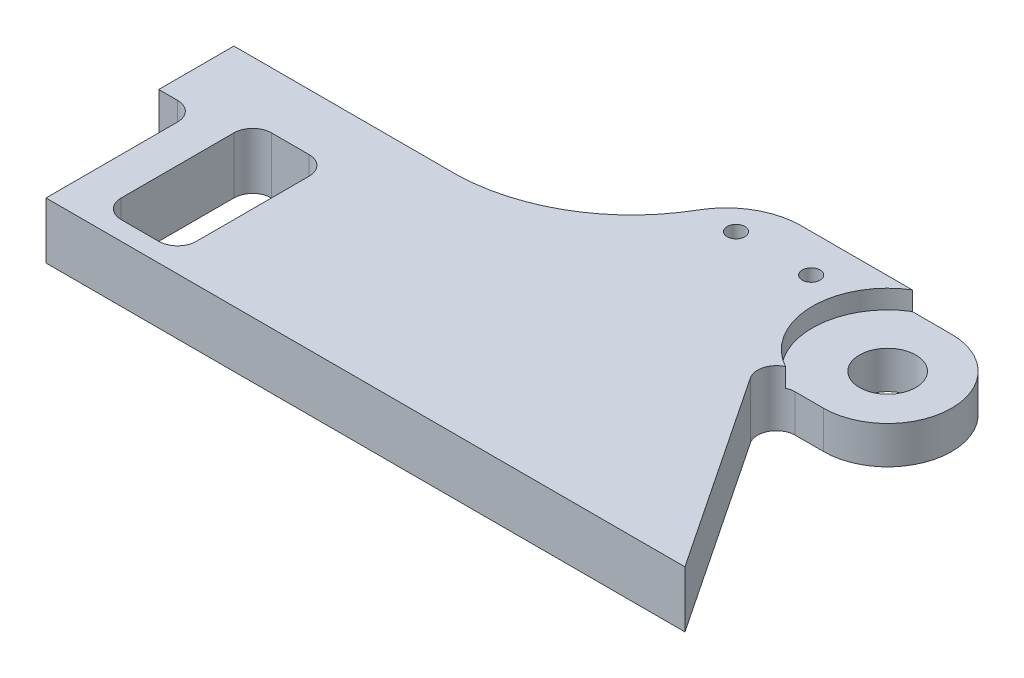
ISO-10303-21;
HEADER;
FILE_DESCRIPTION(('STEP AP214'),'2;1');
FILE_NAME('part.step','',(''),(''),'','','');
FILE_SCHEMA(('AUTOMOTIVE_DESIGN { 1 0 10303 214 1 1 1 1 }'));
ENDSEC;
DATA;
#1=APPLICATION_CONTEXT('core data for automotive mechanical design processes');
#2=APPLICATION_PROTOCOL_DEFINITION('international standard','automotive_design',2000,#1);
#3=PRODUCT_CONTEXT('',#1,'mechanical');
#4=PRODUCT('Part','Part','',(#3));
#5=PRODUCT_RELATED_PRODUCT_CATEGORY('part','',(#4));
#6=PRODUCT_DEFINITION_FORMATION('','',#4);
#7=PRODUCT_DEFINITION_CONTEXT('part definition',#1,'design');
#8=PRODUCT_DEFINITION('design','',#6,#7);
#9=PRODUCT_DEFINITION_SHAPE('','',#8);
#10=(LENGTH_UNIT() NAMED_UNIT(*) SI_UNIT(.MILLI.,.METRE.));
#11=(NAMED_UNIT(*) PLANE_ANGLE_UNIT() SI_UNIT($,.RADIAN.));
#12=(NAMED_UNIT(*) SI_UNIT($,.STERADIAN.) SOLID_ANGLE_UNIT());
#13=UNCERTAINTY_MEASURE_WITH_UNIT(LENGTH_MEASURE(1.E-05),#10,'distance_accuracy_value','');
#14=(GEOMETRIC_REPRESENTATION_CONTEXT(3) GLOBAL_UNCERTAINTY_ASSIGNED_CONTEXT((#13)) GLOBAL_UNIT_ASSIGNED_CONTEXT((#10,
#11,#12)) REPRESENTATION_CONTEXT('',''));
#15=CARTESIAN_POINT('',(0.,0.,0.));
#16=DIRECTION('',(0.,0.,1.));
#17=DIRECTION('',(1.,0.,0.));
#18=AXIS2_PLACEMENT_3D('',#15,#16,#17);
#19=CARTESIAN_POINT('',(99.6289220182295,9.525,0.));
#20=DIRECTION('',(0.,0.,-1.));
#21=DIRECTION('',(-1.,0.,0.));
#22=AXIS2_PLACEMENT_3D('',#19,#20,#21);
#23=PLANE('',#22);
#24=DIRECTION('',(1.,0.,0.));
#25=VECTOR('',#24,1.);
#26=CARTESIAN_POINT('',(99.6289220182295,6.35,0.));
#27=LINE('',#26,#25);
#28=CARTESIAN_POINT('',(94.8325417665327,6.35,0.));
#29=VERTEX_POINT('',#28);
#30=CARTESIAN_POINT('',(99.6289220182295,6.35,0.));
#31=VERTEX_POINT('',#30);
#32=EDGE_CURVE('E432',#29,#31,#27,.T.);
#33=ORIENTED_EDGE('',*,*,#32,.F.);
#34=DIRECTION('',(0.,-1.,0.));
#35=VECTOR('',#34,1.);
#36=CARTESIAN_POINT('',(94.8325417665327,0.,0.));
#37=LINE('',#36,#35);
#38=CARTESIAN_POINT('',(94.8325417665327,0.,0.));
#39=VERTEX_POINT('',#38);
#40=EDGE_CURVE('E314',#29,#39,#37,.T.);
#41=ORIENTED_EDGE('',*,*,#40,.T.);
#42=DIRECTION('',(1.,0.,0.));
#43=VECTOR('',#42,1.);
#44=CARTESIAN_POINT('',(99.6289220182295,0.,0.));
#45=LINE('',#44,#43);
#46=CARTESIAN_POINT('',(99.6289220182295,0.,0.));
#47=VERTEX_POINT('',#46);
#48=EDGE_CURVE('E262',#39,#47,#45,.T.);
#49=ORIENTED_EDGE('',*,*,#48,.T.);
#50=DIRECTION('',(0.,-1.,0.));
#51=VECTOR('',#50,1.);
#52=CARTESIAN_POINT('',(99.6289220182295,9.525,0.));
#53=LINE('',#52,#51);
#54=EDGE_CURVE('E299',#31,#47,#53,.T.);
#55=ORIENTED_EDGE('',*,*,#54,.F.);
#56=EDGE_LOOP('',(#33,#41,#49,#55));
#57=FACE_BOUND('',#56,.T.);
#58=ADVANCED_FACE('F39',(#57),#23,.F.);
#59=CARTESIAN_POINT('',(99.6289220182295,9.525,-10.8159932240115));
#60=DIRECTION('',(0.,-1.,0.));
#61=DIRECTION('',(0.,0.,-1.));
#62=AXIS2_PLACEMENT_3D('',#59,#60,#61);
#63=CYLINDRICAL_SURFACE('',#62,10.8159932240115);
#64=CARTESIAN_POINT('',(99.6289220182295,6.35,-10.8159932240115));
#65=DIRECTION('',(0.,1.,0.));
#66=DIRECTION('',(0.,0.,1.));
#67=AXIS2_PLACEMENT_3D('',#64,#65,#66);
#68=CIRCLE('',#67,10.8159932240115);
#69=CARTESIAN_POINT('',(99.6289220182295,6.35,-21.6319864480231));
#70=VERTEX_POINT('',#69);
#71=EDGE_CURVE('E436',#31,#70,#68,.T.);
#72=ORIENTED_EDGE('',*,*,#71,.F.);
#73=ORIENTED_EDGE('',*,*,#54,.T.);
#74=CARTESIAN_POINT('',(99.6289220182295,0.,-10.8159932240115));
#75=DIRECTION('',(0.,1.,0.));
#76=DIRECTION('',(0.,0.,-1.));
#77=AXIS2_PLACEMENT_3D('',#74,#75,#76);
#78=CIRCLE('',#77,10.8159932240115);
#79=CARTESIAN_POINT('',(99.6289220182295,0.,-21.6319864480231));
#80=VERTEX_POINT('',#79);
#81=EDGE_CURVE('E266',#47,#80,#78,.T.);
#82=ORIENTED_EDGE('',*,*,#81,.T.);
#83=DIRECTION('',(0.,-1.,0.));
#84=VECTOR('',#83,1.);
#85=CARTESIAN_POINT('',(99.6289220182295,9.525,-21.6319864480231));
#86=LINE('',#85,#84);
#87=EDGE_CURVE('E296',#70,#80,#86,.T.);
#88=ORIENTED_EDGE('',*,*,#87,.F.);
#89=EDGE_LOOP('',(#72,#73,#82,#88));
#90=FACE_BOUND('',#89,.T.);
#91=ADVANCED_FACE('F499',(#90),#63,.T.);
#92=CARTESIAN_POINT('',(99.6289220182295,9.525,-10.8159932240115));
#93=DIRECTION('',(0.,-1.,0.));
#94=DIRECTION('',(0.,0.,-1.));
#95=AXIS2_PLACEMENT_3D('',#92,#93,#94);
#96=CYLINDRICAL_SURFACE('',#95,4.76250000000001);
#97=CARTESIAN_POINT('',(99.6289220182295,0.,-10.8159932240115));
#98=DIRECTION('',(0.,1.,0.));
#99=DIRECTION('',(0.,0.,1.));
#100=AXIS2_PLACEMENT_3D('',#97,#98,#99);
#101=CIRCLE('',#100,4.76250000000001);
#102=CARTESIAN_POINT('',(99.6289220182295,0.,-6.05349322401153));
#103=VERTEX_POINT('',#102);
#104=EDGE_CURVE('E248',#103,#103,#101,.T.);
#105=ORIENTED_EDGE('',*,*,#104,.F.);
#106=EDGE_LOOP('',(#105));
#107=FACE_BOUND('',#106,.T.);
#108=CARTESIAN_POINT('',(99.6289220182295,6.35,-10.8159932240115));
#109=DIRECTION('',(0.,1.,0.));
#110=DIRECTION('',(0.,0.,1.));
#111=AXIS2_PLACEMENT_3D('',#108,#109,#110);
#112=CIRCLE('',#111,4.76250000000001);
#113=CARTESIAN_POINT('',(99.6289220182295,6.35,-6.05349322401153));
#114=VERTEX_POINT('',#113);
#115=EDGE_CURVE('E207',#114,#114,#112,.T.);
#116=ORIENTED_EDGE('',*,*,#115,.T.);
#117=EDGE_LOOP('',(#116));
#118=FACE_BOUND('',#117,.T.);
#119=ADVANCED_FACE('F547',(#107,#118),#96,.F.);
#120=CARTESIAN_POINT('',(36.7936206027921,9.525,-30.4519912792341));
#121=DIRECTION('',(0.,-1.,0.));
#122=DIRECTION('',(0.,0.,-1.));
#123=AXIS2_PLACEMENT_3D('',#120,#121,#122);
#124=PLANE('',#123);
#125=DIRECTION('',(0.,0.,1.));
#126=VECTOR('',#125,1.);
#127=CARTESIAN_POINT('',(12.7,9.525,9.52500000000002));
#128=LINE('',#127,#126);
#129=CARTESIAN_POINT('',(12.7,9.525,12.7));
#130=VERTEX_POINT('',#129);
#131=CARTESIAN_POINT('',(12.7,9.525,31.75));
#132=VERTEX_POINT('',#131);
#133=EDGE_CURVE('E424',#130,#132,#128,.T.);
#134=ORIENTED_EDGE('',*,*,#133,.F.);
#135=CARTESIAN_POINT('',(15.875,9.525,12.7));
#136=DIRECTION('',(0.,-1.,0.));
#137=DIRECTION('',(0.,0.,-1.));
#138=AXIS2_PLACEMENT_3D('',#135,#136,#137);
#139=CIRCLE('',#138,3.175);
#140=CARTESIAN_POINT('',(15.875,9.525,9.52500000000002));
#141=VERTEX_POINT('',#140);
#142=EDGE_CURVE('E383',#130,#141,#139,.T.);
#143=ORIENTED_EDGE('',*,*,#142,.T.);
#144=DIRECTION('',(-1.,0.,0.));
#145=VECTOR('',#144,1.);
#146=CARTESIAN_POINT('',(25.4,9.525,9.52500000000002));
#147=LINE('',#146,#145);
#148=CARTESIAN_POINT('',(22.225,9.525,9.52500000000002));
#149=VERTEX_POINT('',#148);
#150=EDGE_CURVE('E395',#149,#141,#147,.T.);
#151=ORIENTED_EDGE('',*,*,#150,.F.);
#152=CARTESIAN_POINT('',(22.225,9.525,12.7));
#153=DIRECTION('',(0.,-1.,0.));
#154=DIRECTION('',(0.,0.,-1.));
#155=AXIS2_PLACEMENT_3D('',#152,#153,#154);
#156=CIRCLE('',#155,3.175);
#157=CARTESIAN_POINT('',(25.4,9.525,12.7));
#158=VERTEX_POINT('',#157);
#159=EDGE_CURVE('E48',#149,#158,#156,.T.);
#160=ORIENTED_EDGE('',*,*,#159,.T.);
#161=DIRECTION('',(0.,0.,-1.));
#162=VECTOR('',#161,1.);
#163=CARTESIAN_POINT('',(25.4,9.525,34.925));
#164=LINE('',#163,#162);
#165=CARTESIAN_POINT('',(25.4,9.525,31.75));
#166=VERTEX_POINT('',#165);
#167=EDGE_CURVE('E394',#166,#158,#164,.T.);
#168=ORIENTED_EDGE('',*,*,#167,.F.);
#169=CARTESIAN_POINT('',(22.225,9.525,31.75));
#170=DIRECTION('',(0.,-1.,0.));
#171=DIRECTION('',(0.,0.,-1.));
#172=AXIS2_PLACEMENT_3D('',#169,#170,#171);
#173=CIRCLE('',#172,3.175);
#174=CARTESIAN_POINT('',(22.225,9.525,34.925));
#175=VERTEX_POINT('',#174);
#176=EDGE_CURVE('E371',#166,#175,#173,.T.);
#177=ORIENTED_EDGE('',*,*,#176,.T.);
#178=DIRECTION('',(1.,0.,0.));
#179=VECTOR('',#178,1.);
#180=CARTESIAN_POINT('',(12.7,9.525,34.925));
#181=LINE('',#180,#179);
#182=CARTESIAN_POINT('',(15.875,9.525,34.925));
#183=VERTEX_POINT('',#182);
#184=EDGE_CURVE('E405',#183,#175,#181,.T.);
#185=ORIENTED_EDGE('',*,*,#184,.F.);
#186=CARTESIAN_POINT('',(15.875,9.525,31.75));
#187=DIRECTION('',(0.,-1.,0.));
#188=DIRECTION('',(0.,0.,-1.));
#189=AXIS2_PLACEMENT_3D('',#186,#187,#188);
#190=CIRCLE('',#189,3.175);
#191=EDGE_CURVE('E377',#183,#132,#190,.T.);
#192=ORIENTED_EDGE('',*,*,#191,.T.);
#193=EDGE_LOOP('',(#134,#143,#151,#160,#168,#177,#185,#192));
#194=FACE_BOUND('',#193,.T.);
#195=CARTESIAN_POINT('',(94.8325417665327,9.525,3.175));
#196=DIRECTION('',(0.,-1.,0.));
#197=DIRECTION('',(0.,0.,-1.));
#198=AXIS2_PLACEMENT_3D('',#195,#196,#197);
#199=CIRCLE('',#198,3.175);
#200=CARTESIAN_POINT('',(92.1907820820101,9.525,4.9361731230151));
#201=VERTEX_POINT('',#200);
#202=CARTESIAN_POINT('',(93.486164763583,9.525,0.299605424306388));
#203=VERTEX_POINT('',#202);
#204=EDGE_CURVE('E217',#201,#203,#199,.T.);
#205=ORIENTED_EDGE('',*,*,#204,.T.);
#206=CARTESIAN_POINT('',(99.6289220182295,9.525,-10.8159932240115));
#207=DIRECTION('',(0.,1.,0.));
#208=DIRECTION('',(0.,0.,1.));
#209=AXIS2_PLACEMENT_3D('',#206,#207,#208);
#210=CIRCLE('',#209,12.7);
#211=CARTESIAN_POINT('',(92.9727751915635,9.525,-21.6319864480231));
#212=VERTEX_POINT('',#211);
#213=EDGE_CURVE('E199',#212,#203,#210,.T.);
#214=ORIENTED_EDGE('',*,*,#213,.F.);
#215=DIRECTION('',(-1.,0.,0.));
#216=VECTOR('',#215,1.);
#217=CARTESIAN_POINT('',(99.6289220182295,9.525,-21.6319864480231));
#218=LINE('',#217,#216);
#219=CARTESIAN_POINT('',(74.2289220182296,9.525,-21.6319864480231));
#220=VERTEX_POINT('',#219);
#221=EDGE_CURVE('E213',#212,#220,#218,.T.);
#222=ORIENTED_EDGE('',*,*,#221,.T.);
#223=CARTESIAN_POINT('',(74.2289220182296,9.525,-8.93198644802308));
#224=DIRECTION('',(0.,1.,0.));
#225=DIRECTION('',(0.,0.,1.));
#226=AXIS2_PLACEMENT_3D('',#223,#224,#225);
#227=CIRCLE('',#226,12.7);
#228=CARTESIAN_POINT('',(63.2185392489832,9.525,-15.2613996336734));
#229=VERTEX_POINT('',#228);
#230=EDGE_CURVE('E226',#220,#229,#227,.T.);
#231=ORIENTED_EDGE('',*,*,#230,.T.);
#232=CARTESIAN_POINT('',(36.7936206027921,9.525,-30.4519912792341));
#233=DIRECTION('',(0.,-1.,0.));
#234=DIRECTION('',(0.,0.,-1.));
#235=AXIS2_PLACEMENT_3D('',#232,#233,#234);
#236=CIRCLE('',#235,30.48);
#237=CARTESIAN_POINT('',(38.1,9.525,0.));
#238=VERTEX_POINT('',#237);
#239=EDGE_CURVE('E231',#229,#238,#236,.T.);
#240=ORIENTED_EDGE('',*,*,#239,.T.);
#241=DIRECTION('',(-1.,0.,0.));
#242=VECTOR('',#241,1.);
#243=CARTESIAN_POINT('',(0.,9.525,0.));
#244=LINE('',#243,#242);
#245=CARTESIAN_POINT('',(0.,9.525,0.));
#246=VERTEX_POINT('',#245);
#247=EDGE_CURVE('E239',#238,#246,#244,.T.);
#248=ORIENTED_EDGE('',*,*,#247,.T.);
#249=DIRECTION('',(0.,0.,1.));
#250=VECTOR('',#249,1.);
#251=CARTESIAN_POINT('',(0.,9.525,12.7));
#252=LINE('',#251,#250);
#253=CARTESIAN_POINT('',(0.,9.525,12.7));
#254=VERTEX_POINT('',#253);
#255=EDGE_CURVE('E282',#246,#254,#252,.T.);
#256=ORIENTED_EDGE('',*,*,#255,.T.);
#257=DIRECTION('',(1.,0.,0.));
#258=VECTOR('',#257,1.);
#259=CARTESIAN_POINT('',(6.35,9.525,12.7));
#260=LINE('',#259,#258);
#261=CARTESIAN_POINT('',(3.175,9.525,12.7));
#262=VERTEX_POINT('',#261);
#263=EDGE_CURVE('E466',#254,#262,#260,.T.);
#264=ORIENTED_EDGE('',*,*,#263,.T.);
#265=CARTESIAN_POINT('',(3.175,9.525,15.875));
#266=DIRECTION('',(0.,-1.,0.));
#267=DIRECTION('',(0.,0.,-1.));
#268=AXIS2_PLACEMENT_3D('',#265,#266,#267);
#269=CIRCLE('',#268,3.175);
#270=CARTESIAN_POINT('',(6.35,9.525,15.875));
#271=VERTEX_POINT('',#270);
#272=EDGE_CURVE('E335',#262,#271,#269,.T.);
#273=ORIENTED_EDGE('',*,*,#272,.T.);
#274=DIRECTION('',(0.,0.,1.));
#275=VECTOR('',#274,1.);
#276=CARTESIAN_POINT('',(6.35,9.525,38.1));
#277=LINE('',#276,#275);
#278=CARTESIAN_POINT('',(6.35,9.525,38.1));
#279=VERTEX_POINT('',#278);
#280=EDGE_CURVE('E470',#271,#279,#277,.T.);
#281=ORIENTED_EDGE('',*,*,#280,.T.);
#282=DIRECTION('',(1.,0.,0.));
#283=VECTOR('',#282,1.);
#284=CARTESIAN_POINT('',(114.3,9.525,38.1));
#285=LINE('',#284,#283);
#286=CARTESIAN_POINT('',(114.3,9.525,38.1));
#287=VERTEX_POINT('',#286);
#288=EDGE_CURVE('E233',#279,#287,#285,.T.);
#289=ORIENTED_EDGE('',*,*,#288,.T.);
#290=DIRECTION('',(-0.554700196225229,0.,-0.832050294337844));
#291=VECTOR('',#290,1.);
#292=CARTESIAN_POINT('',(88.9,9.525,0.));
#293=LINE('',#292,#291);
#294=EDGE_CURVE('E227',#287,#201,#293,.T.);
#295=ORIENTED_EDGE('',*,*,#294,.T.);
#296=EDGE_LOOP('',(#205,#214,#222,#231,#240,#248,#256,#264,#273,#281,#289,#295));
#297=FACE_BOUND('',#296,.T.);
#298=CARTESIAN_POINT('',(69.5685392489832,9.525,-15.2613996336734));
#299=DIRECTION('',(0.,1.,0.));
#300=DIRECTION('',(0.,0.,1.));
#301=AXIS2_PLACEMENT_3D('',#298,#299,#300);
#302=CIRCLE('',#301,1.5);
#303=CARTESIAN_POINT('',(69.5685392489832,9.525,-13.7613996336734));
#304=VERTEX_POINT('',#303);
#305=EDGE_CURVE('E453',#304,#304,#302,.T.);
#306=ORIENTED_EDGE('',*,*,#305,.F.);
#307=EDGE_LOOP('',(#306));
#308=FACE_BOUND('',#307,.T.);
#309=CARTESIAN_POINT('',(82.2685392489832,9.525,-15.2613996336734));
#310=DIRECTION('',(0.,1.,0.));
#311=DIRECTION('',(0.,0.,1.));
#312=AXIS2_PLACEMENT_3D('',#309,#310,#311);
#313=CIRCLE('',#312,1.5);
#314=CARTESIAN_POINT('',(82.2685392489832,9.525,-13.7613996336734));
#315=VERTEX_POINT('',#314);
#316=EDGE_CURVE('E445',#315,#315,#313,.T.);
#317=ORIENTED_EDGE('',*,*,#316,.F.);
#318=EDGE_LOOP('',(#317));
#319=FACE_BOUND('',#318,.T.);
#320=ADVANCED_FACE('F211',(#194,#297,#308,#319),#124,.F.);
#321=CARTESIAN_POINT('',(36.7936206027921,0.,-30.4519912792341));
#322=DIRECTION('',(0.,-1.,0.));
#323=DIRECTION('',(0.,0.,-1.));
#324=AXIS2_PLACEMENT_3D('',#321,#322,#323);
#325=PLANE('',#324);
#326=DIRECTION('',(0.,0.,-1.));
#327=VECTOR('',#326,1.);
#328=CARTESIAN_POINT('',(25.4,0.,34.925));
#329=LINE('',#328,#327);
#330=CARTESIAN_POINT('',(25.4,0.,31.75));
#331=VERTEX_POINT('',#330);
#332=CARTESIAN_POINT('',(25.4,0.,12.7));
#333=VERTEX_POINT('',#332);
#334=EDGE_CURVE('E219',#331,#333,#329,.T.);
#335=ORIENTED_EDGE('',*,*,#334,.T.);
#336=CARTESIAN_POINT('',(22.225,0.,12.7));
#337=DIRECTION('',(0.,-1.,0.));
#338=DIRECTION('',(0.,0.,-1.));
#339=AXIS2_PLACEMENT_3D('',#336,#337,#338);
#340=CIRCLE('',#339,3.175);
#341=CARTESIAN_POINT('',(22.225,0.,9.52500000000002));
#342=VERTEX_POINT('',#341);
#343=EDGE_CURVE('E11',#333,#342,#340,.F.);
#344=ORIENTED_EDGE('',*,*,#343,.T.);
#345=DIRECTION('',(-1.,0.,0.));
#346=VECTOR('',#345,1.);
#347=CARTESIAN_POINT('',(25.4,0.,9.52500000000002));
#348=LINE('',#347,#346);
#349=CARTESIAN_POINT('',(15.875,0.,9.52500000000002));
#350=VERTEX_POINT('',#349);
#351=EDGE_CURVE('E404',#342,#350,#348,.T.);
#352=ORIENTED_EDGE('',*,*,#351,.T.);
#353=CARTESIAN_POINT('',(15.875,0.,12.7));
#354=DIRECTION('',(0.,-1.,0.));
#355=DIRECTION('',(0.,0.,-1.));
#356=AXIS2_PLACEMENT_3D('',#353,#354,#355);
#357=CIRCLE('',#356,3.175);
#358=CARTESIAN_POINT('',(12.7,0.,12.7));
#359=VERTEX_POINT('',#358);
#360=EDGE_CURVE('E386',#350,#359,#357,.F.);
#361=ORIENTED_EDGE('',*,*,#360,.T.);
#362=DIRECTION('',(0.,0.,1.));
#363=VECTOR('',#362,1.);
#364=CARTESIAN_POINT('',(12.7,0.,9.52500000000002));
#365=LINE('',#364,#363);
#366=CARTESIAN_POINT('',(12.7,0.,31.75));
#367=VERTEX_POINT('',#366);
#368=EDGE_CURVE('E410',#359,#367,#365,.T.);
#369=ORIENTED_EDGE('',*,*,#368,.T.);
#370=CARTESIAN_POINT('',(15.875,0.,31.75));
#371=DIRECTION('',(0.,-1.,0.));
#372=DIRECTION('',(0.,0.,-1.));
#373=AXIS2_PLACEMENT_3D('',#370,#371,#372);
#374=CIRCLE('',#373,3.175);
#375=CARTESIAN_POINT('',(15.875,0.,34.925));
#376=VERTEX_POINT('',#375);
#377=EDGE_CURVE('E380',#367,#376,#374,.F.);
#378=ORIENTED_EDGE('',*,*,#377,.T.);
#379=DIRECTION('',(1.,0.,0.));
#380=VECTOR('',#379,1.);
#381=CARTESIAN_POINT('',(12.7,0.,34.925));
#382=LINE('',#381,#380);
#383=CARTESIAN_POINT('',(22.225,0.,34.925));
#384=VERTEX_POINT('',#383);
#385=EDGE_CURVE('E414',#376,#384,#382,.T.);
#386=ORIENTED_EDGE('',*,*,#385,.T.);
#387=CARTESIAN_POINT('',(22.225,0.,31.75));
#388=DIRECTION('',(0.,-1.,0.));
#389=DIRECTION('',(0.,0.,-1.));
#390=AXIS2_PLACEMENT_3D('',#387,#388,#389);
#391=CIRCLE('',#390,3.175);
#392=EDGE_CURVE('E374',#384,#331,#391,.F.);
#393=ORIENTED_EDGE('',*,*,#392,.T.);
#394=EDGE_LOOP('',(#335,#344,#352,#361,#369,#378,#386,#393));
#395=FACE_BOUND('',#394,.T.);
#396=CARTESIAN_POINT('',(69.5685392489832,0.,-15.2613996336734));
#397=DIRECTION('',(0.,1.,0.));
#398=DIRECTION('',(0.,0.,1.));
#399=AXIS2_PLACEMENT_3D('',#396,#397,#398);
#400=CIRCLE('',#399,1.5);
#401=CARTESIAN_POINT('',(69.5685392489832,0.,-13.7613996336734));
#402=VERTEX_POINT('',#401);
#403=EDGE_CURVE('E449',#402,#402,#400,.T.);
#404=ORIENTED_EDGE('',*,*,#403,.T.);
#405=EDGE_LOOP('',(#404));
#406=FACE_BOUND('',#405,.T.);
#407=DIRECTION('',(0.,0.,1.));
#408=VECTOR('',#407,1.);
#409=CARTESIAN_POINT('',(0.,0.,12.7));
#410=LINE('',#409,#408);
#411=CARTESIAN_POINT('',(0.,0.,0.));
#412=VERTEX_POINT('',#411);
#413=CARTESIAN_POINT('',(0.,0.,12.7));
#414=VERTEX_POINT('',#413);
#415=EDGE_CURVE('E243',#412,#414,#410,.T.);
#416=ORIENTED_EDGE('',*,*,#415,.F.);
#417=DIRECTION('',(-1.,0.,0.));
#418=VECTOR('',#417,1.);
#419=CARTESIAN_POINT('',(0.,0.,0.));
#420=LINE('',#419,#418);
#421=CARTESIAN_POINT('',(38.1,0.,0.));
#422=VERTEX_POINT('',#421);
#423=EDGE_CURVE('E279',#422,#412,#420,.T.);
#424=ORIENTED_EDGE('',*,*,#423,.F.);
#425=CARTESIAN_POINT('',(36.7936206027921,0.,-30.4519912792341));
#426=DIRECTION('',(0.,-1.,0.));
#427=DIRECTION('',(0.,0.,-1.));
#428=AXIS2_PLACEMENT_3D('',#425,#426,#427);
#429=CIRCLE('',#428,30.48);
#430=CARTESIAN_POINT('',(63.2185392489832,0.,-15.2613996336734));
#431=VERTEX_POINT('',#430);
#432=EDGE_CURVE('E276',#431,#422,#429,.T.);
#433=ORIENTED_EDGE('',*,*,#432,.F.);
#434=CARTESIAN_POINT('',(74.2289220182296,0.,-8.93198644802308));
#435=DIRECTION('',(0.,1.,0.));
#436=DIRECTION('',(0.,0.,1.));
#437=AXIS2_PLACEMENT_3D('',#434,#435,#436);
#438=CIRCLE('',#437,12.7);
#439=CARTESIAN_POINT('',(74.2289220182296,0.,-21.6319864480231));
#440=VERTEX_POINT('',#439);
#441=EDGE_CURVE('E273',#440,#431,#438,.T.);
#442=ORIENTED_EDGE('',*,*,#441,.F.);
#443=DIRECTION('',(-1.,0.,0.));
#444=VECTOR('',#443,1.);
#445=CARTESIAN_POINT('',(99.6289220182295,0.,-21.6319864480231));
#446=LINE('',#445,#444);
#447=EDGE_CURVE('E270',#80,#440,#446,.T.);
#448=ORIENTED_EDGE('',*,*,#447,.F.);
#449=ORIENTED_EDGE('',*,*,#81,.F.);
#450=ORIENTED_EDGE('',*,*,#48,.F.);
#451=CARTESIAN_POINT('',(94.8325417665327,0.,3.175));
#452=DIRECTION('',(0.,-1.,0.));
#453=DIRECTION('',(0.,0.,-1.));
#454=AXIS2_PLACEMENT_3D('',#451,#452,#453);
#455=CIRCLE('',#454,3.175);
#456=CARTESIAN_POINT('',(92.1907820820101,0.,4.9361731230151));
#457=VERTEX_POINT('',#456);
#458=EDGE_CURVE('E320',#39,#457,#455,.F.);
#459=ORIENTED_EDGE('',*,*,#458,.T.);
#460=DIRECTION('',(-0.554700196225229,0.,-0.832050294337844));
#461=VECTOR('',#460,1.);
#462=CARTESIAN_POINT('',(88.9,0.,0.));
#463=LINE('',#462,#461);
#464=CARTESIAN_POINT('',(114.3,0.,38.1));
#465=VERTEX_POINT('',#464);
#466=EDGE_CURVE('E258',#465,#457,#463,.T.);
#467=ORIENTED_EDGE('',*,*,#466,.F.);
#468=DIRECTION('',(1.,0.,0.));
#469=VECTOR('',#468,1.);
#470=CARTESIAN_POINT('',(114.3,0.,38.1));
#471=LINE('',#470,#469);
#472=CARTESIAN_POINT('',(6.35,0.,38.1));
#473=VERTEX_POINT('',#472);
#474=EDGE_CURVE('E255',#473,#465,#471,.T.);
#475=ORIENTED_EDGE('',*,*,#474,.F.);
#476=DIRECTION('',(0.,0.,1.));
#477=VECTOR('',#476,1.);
#478=CARTESIAN_POINT('',(6.35,0.,38.1));
#479=LINE('',#478,#477);
#480=CARTESIAN_POINT('',(6.35,0.,15.875));
#481=VERTEX_POINT('',#480);
#482=EDGE_CURVE('E252',#481,#473,#479,.T.);
#483=ORIENTED_EDGE('',*,*,#482,.F.);
#484=CARTESIAN_POINT('',(3.175,0.,15.875));
#485=DIRECTION('',(0.,-1.,0.));
#486=DIRECTION('',(0.,0.,-1.));
#487=AXIS2_PLACEMENT_3D('',#484,#485,#486);
#488=CIRCLE('',#487,3.175);
#489=CARTESIAN_POINT('',(3.175,0.,12.7));
#490=VERTEX_POINT('',#489);
#491=EDGE_CURVE('E332',#481,#490,#488,.F.);
#492=ORIENTED_EDGE('',*,*,#491,.T.);
#493=DIRECTION('',(1.,0.,0.));
#494=VECTOR('',#493,1.);
#495=CARTESIAN_POINT('',(6.35,0.,12.7));
#496=LINE('',#495,#494);
#497=EDGE_CURVE('E247',#414,#490,#496,.T.);
#498=ORIENTED_EDGE('',*,*,#497,.F.);
#499=EDGE_LOOP('',(#416,#424,#433,#442,#448,#449,#450,#459,#467,#475,#483,#492,#498));
#500=FACE_BOUND('',#499,.T.);
#501=ORIENTED_EDGE('',*,*,#104,.T.);
#502=EDGE_LOOP('',(#501));
#503=FACE_BOUND('',#502,.T.);
#504=CARTESIAN_POINT('',(82.2685392489832,0.,-15.2613996336734));
#505=DIRECTION('',(0.,1.,0.));
#506=DIRECTION('',(0.,0.,1.));
#507=AXIS2_PLACEMENT_3D('',#504,#505,#506);
#508=CIRCLE('',#507,1.5);
#509=CARTESIAN_POINT('',(82.2685392489832,0.,-13.7613996336734));
#510=VERTEX_POINT('',#509);
#511=EDGE_CURVE('E206',#510,#510,#508,.T.);
#512=ORIENTED_EDGE('',*,*,#511,.T.);
#513=EDGE_LOOP('',(#512));
#514=FACE_BOUND('',#513,.T.);
#515=ADVANCED_FACE('F509',(#395,#406,#500,#503,#514),#325,.T.);
#516=CARTESIAN_POINT('',(0.,9.525,12.7));
#517=DIRECTION('',(1.,0.,0.));
#518=DIRECTION('',(0.,0.,-1.));
#519=AXIS2_PLACEMENT_3D('',#516,#517,#518);
#520=PLANE('',#519);
#521=ORIENTED_EDGE('',*,*,#415,.T.);
#522=DIRECTION('',(0.,-1.,0.));
#523=VECTOR('',#522,1.);
#524=CARTESIAN_POINT('',(0.,9.525,12.7));
#525=LINE('',#524,#523);
#526=EDGE_CURVE('E310',#254,#414,#525,.T.);
#527=ORIENTED_EDGE('',*,*,#526,.F.);
#528=ORIENTED_EDGE('',*,*,#255,.F.);
#529=DIRECTION('',(0.,-1.,0.));
#530=VECTOR('',#529,1.);
#531=CARTESIAN_POINT('',(0.,9.525,0.));
#532=LINE('',#531,#530);
#533=EDGE_CURVE('E242',#246,#412,#532,.T.);
#534=ORIENTED_EDGE('',*,*,#533,.T.);
#535=EDGE_LOOP('',(#521,#527,#528,#534));
#536=FACE_BOUND('',#535,.T.);
#537=ADVANCED_FACE('F524',(#536),#520,.F.);
#538=CARTESIAN_POINT('',(6.35,9.525,12.7));
#539=DIRECTION('',(0.,0.,-1.));
#540=DIRECTION('',(-1.,0.,0.));
#541=AXIS2_PLACEMENT_3D('',#538,#539,#540);
#542=PLANE('',#541);
#543=ORIENTED_EDGE('',*,*,#497,.T.);
#544=DIRECTION('',(0.,-1.,0.));
#545=VECTOR('',#544,1.);
#546=CARTESIAN_POINT('',(3.175,9.525,12.7));
#547=LINE('',#546,#545);
#548=EDGE_CURVE('E329',#490,#262,#547,.F.);
#549=ORIENTED_EDGE('',*,*,#548,.T.);
#550=ORIENTED_EDGE('',*,*,#263,.F.);
#551=ORIENTED_EDGE('',*,*,#526,.T.);
#552=EDGE_LOOP('',(#543,#549,#550,#551));
#553=FACE_BOUND('',#552,.T.);
#554=ADVANCED_FACE('F526',(#553),#542,.F.);
#555=CARTESIAN_POINT('',(6.35,9.525,38.1));
#556=DIRECTION('',(1.,0.,0.));
#557=DIRECTION('',(0.,0.,-1.));
#558=AXIS2_PLACEMENT_3D('',#555,#556,#557);
#559=PLANE('',#558);
#560=ORIENTED_EDGE('',*,*,#280,.F.);
#561=DIRECTION('',(0.,-1.,0.));
#562=VECTOR('',#561,1.);
#563=CARTESIAN_POINT('',(6.35,0.,15.875));
#564=LINE('',#563,#562);
#565=EDGE_CURVE('E325',#271,#481,#564,.T.);
#566=ORIENTED_EDGE('',*,*,#565,.T.);
#567=ORIENTED_EDGE('',*,*,#482,.T.);
#568=DIRECTION('',(0.,-1.,0.));
#569=VECTOR('',#568,1.);
#570=CARTESIAN_POINT('',(6.35,9.525,38.1));
#571=LINE('',#570,#569);
#572=EDGE_CURVE('E306',#279,#473,#571,.T.);
#573=ORIENTED_EDGE('',*,*,#572,.F.);
#574=EDGE_LOOP('',(#560,#566,#567,#573));
#575=FACE_BOUND('',#574,.T.);
#576=ADVANCED_FACE('F532',(#575),#559,.F.);
#577=CARTESIAN_POINT('',(114.3,9.525,38.1));
#578=DIRECTION('',(0.,0.,-1.));
#579=DIRECTION('',(-1.,0.,0.));
#580=AXIS2_PLACEMENT_3D('',#577,#578,#579);
#581=PLANE('',#580);
#582=ORIENTED_EDGE('',*,*,#474,.T.);
#583=DIRECTION('',(0.,-1.,0.));
#584=VECTOR('',#583,1.);
#585=CARTESIAN_POINT('',(114.3,9.525,38.1));
#586=LINE('',#585,#584);
#587=EDGE_CURVE('E302',#287,#465,#586,.T.);
#588=ORIENTED_EDGE('',*,*,#587,.F.);
#589=ORIENTED_EDGE('',*,*,#288,.F.);
#590=ORIENTED_EDGE('',*,*,#572,.T.);
#591=EDGE_LOOP('',(#582,#588,#589,#590));
#592=FACE_BOUND('',#591,.T.);
#593=ADVANCED_FACE('F479',(#592),#581,.F.);
#594=CARTESIAN_POINT('',(88.9,9.525,0.));
#595=DIRECTION('',(-0.832050294337844,0.,0.554700196225229));
#596=DIRECTION('',(0.554700196225229,0.,0.832050294337844));
#597=AXIS2_PLACEMENT_3D('',#594,#595,#596);
#598=PLANE('',#597);
#599=ORIENTED_EDGE('',*,*,#466,.T.);
#600=DIRECTION('',(0.,-1.,0.));
#601=VECTOR('',#600,1.);
#602=CARTESIAN_POINT('',(92.1907820820101,9.525,4.9361731230151));
#603=LINE('',#602,#601);
#604=EDGE_CURVE('E317',#457,#201,#603,.F.);
#605=ORIENTED_EDGE('',*,*,#604,.T.);
#606=ORIENTED_EDGE('',*,*,#294,.F.);
#607=ORIENTED_EDGE('',*,*,#587,.T.);
#608=EDGE_LOOP('',(#599,#605,#606,#607));
#609=FACE_BOUND('',#608,.T.);
#610=ADVANCED_FACE('F483',(#609),#598,.F.);
#611=CARTESIAN_POINT('',(99.6289220182295,9.525,-21.6319864480231));
#612=DIRECTION('',(0.,0.,1.));
#613=DIRECTION('',(1.,0.,0.));
#614=AXIS2_PLACEMENT_3D('',#611,#612,#613);
#615=PLANE('',#614);
#616=ORIENTED_EDGE('',*,*,#221,.F.);
#617=DIRECTION('',(0.,1.,0.));
#618=VECTOR('',#617,1.);
#619=CARTESIAN_POINT('',(92.9727751915635,6.35,-21.6319864480231));
#620=LINE('',#619,#618);
#621=CARTESIAN_POINT('',(92.9727751915635,6.35,-21.6319864480231));
#622=VERTEX_POINT('',#621);
#623=EDGE_CURVE('E195',#212,#622,#620,.F.);
#624=ORIENTED_EDGE('',*,*,#623,.T.);
#625=DIRECTION('',(-1.,0.,0.));
#626=VECTOR('',#625,1.);
#627=CARTESIAN_POINT('',(99.6289220182295,6.35,-21.6319864480231));
#628=LINE('',#627,#626);
#629=EDGE_CURVE('E439',#70,#622,#628,.T.);
#630=ORIENTED_EDGE('',*,*,#629,.F.);
#631=ORIENTED_EDGE('',*,*,#87,.T.);
#632=ORIENTED_EDGE('',*,*,#447,.T.);
#633=DIRECTION('',(0.,-1.,0.));
#634=VECTOR('',#633,1.);
#635=CARTESIAN_POINT('',(74.2289220182296,9.525,-21.6319864480231));
#636=LINE('',#635,#634);
#637=EDGE_CURVE('E223',#220,#440,#636,.T.);
#638=ORIENTED_EDGE('',*,*,#637,.F.);
#639=EDGE_LOOP('',(#616,#624,#630,#631,#632,#638));
#640=FACE_BOUND('',#639,.T.);
#641=ADVANCED_FACE('F221',(#640),#615,.F.);
#642=CARTESIAN_POINT('',(74.2289220182296,9.525,-8.93198644802308));
#643=DIRECTION('',(0.,-1.,0.));
#644=DIRECTION('',(0.,0.,-1.));
#645=AXIS2_PLACEMENT_3D('',#642,#643,#644);
#646=CYLINDRICAL_SURFACE('',#645,12.7);
#647=ORIENTED_EDGE('',*,*,#441,.T.);
#648=DIRECTION('',(0.,-1.,0.));
#649=VECTOR('',#648,1.);
#650=CARTESIAN_POINT('',(63.2185392489832,9.525,-15.2613996336734));
#651=LINE('',#650,#649);
#652=EDGE_CURVE('E290',#229,#431,#651,.T.);
#653=ORIENTED_EDGE('',*,*,#652,.F.);
#654=ORIENTED_EDGE('',*,*,#230,.F.);
#655=ORIENTED_EDGE('',*,*,#637,.T.);
#656=EDGE_LOOP('',(#647,#653,#654,#655));
#657=FACE_BOUND('',#656,.T.);
#658=ADVANCED_FACE('F505',(#657),#646,.T.);
#659=CARTESIAN_POINT('',(36.7936206027921,9.525,-30.4519912792341));
#660=DIRECTION('',(0.,-1.,0.));
#661=DIRECTION('',(0.,0.,-1.));
#662=AXIS2_PLACEMENT_3D('',#659,#660,#661);
#663=CYLINDRICAL_SURFACE('',#662,30.48);
#664=ORIENTED_EDGE('',*,*,#432,.T.);
#665=DIRECTION('',(0.,-1.,0.));
#666=VECTOR('',#665,1.);
#667=CARTESIAN_POINT('',(38.1,9.525,0.));
#668=LINE('',#667,#666);
#669=EDGE_CURVE('E286',#238,#422,#668,.T.);
#670=ORIENTED_EDGE('',*,*,#669,.F.);
#671=ORIENTED_EDGE('',*,*,#239,.F.);
#672=ORIENTED_EDGE('',*,*,#652,.T.);
#673=EDGE_LOOP('',(#664,#670,#671,#672));
#674=FACE_BOUND('',#673,.T.);
#675=ADVANCED_FACE('F514',(#674),#663,.F.);
#676=CARTESIAN_POINT('',(0.,9.525,0.));
#677=DIRECTION('',(0.,0.,1.));
#678=DIRECTION('',(1.,0.,0.));
#679=AXIS2_PLACEMENT_3D('',#676,#677,#678);
#680=PLANE('',#679);
#681=ORIENTED_EDGE('',*,*,#423,.T.);
#682=ORIENTED_EDGE('',*,*,#533,.F.);
#683=ORIENTED_EDGE('',*,*,#247,.F.);
#684=ORIENTED_EDGE('',*,*,#669,.T.);
#685=EDGE_LOOP('',(#681,#682,#683,#684));
#686=FACE_BOUND('',#685,.T.);
#687=ADVANCED_FACE('F518',(#686),#680,.F.);
#688=CARTESIAN_POINT('',(69.5685392489832,9.525,-15.2613996336734));
#689=DIRECTION('',(0.,-1.,0.));
#690=DIRECTION('',(0.,0.,-1.));
#691=AXIS2_PLACEMENT_3D('',#688,#689,#690);
#692=CYLINDRICAL_SURFACE('',#691,1.5);
#693=ORIENTED_EDGE('',*,*,#305,.T.);
#694=EDGE_LOOP('',(#693));
#695=FACE_BOUND('',#694,.T.);
#696=ORIENTED_EDGE('',*,*,#403,.F.);
#697=EDGE_LOOP('',(#696));
#698=FACE_BOUND('',#697,.T.);
#699=ADVANCED_FACE('F564',(#695,#698),#692,.F.);
#700=CARTESIAN_POINT('',(82.2685392489832,9.525,-15.2613996336734));
#701=DIRECTION('',(0.,-1.,0.));
#702=DIRECTION('',(0.,0.,-1.));
#703=AXIS2_PLACEMENT_3D('',#700,#701,#702);
#704=CYLINDRICAL_SURFACE('',#703,1.5);
#705=ORIENTED_EDGE('',*,*,#316,.T.);
#706=EDGE_LOOP('',(#705));
#707=FACE_BOUND('',#706,.T.);
#708=ORIENTED_EDGE('',*,*,#511,.F.);
#709=EDGE_LOOP('',(#708));
#710=FACE_BOUND('',#709,.T.);
#711=ADVANCED_FACE('F574',(#707,#710),#704,.F.);
#712=CARTESIAN_POINT('',(94.8325417665327,9.525,3.175));
#713=DIRECTION('',(0.,1.,0.));
#714=DIRECTION('',(0.,0.,1.));
#715=AXIS2_PLACEMENT_3D('',#712,#713,#714);
#716=CYLINDRICAL_SURFACE('',#715,3.175);
#717=CARTESIAN_POINT('',(94.8325417665327,6.35,3.175));
#718=DIRECTION('',(0.,1.,0.));
#719=DIRECTION('',(0.,0.,1.));
#720=AXIS2_PLACEMENT_3D('',#717,#718,#719);
#721=CIRCLE('',#720,3.175);
#722=CARTESIAN_POINT('',(93.486164763583,6.35,0.299605424306388));
#723=VERTEX_POINT('',#722);
#724=EDGE_CURVE('E338',#723,#29,#721,.F.);
#725=ORIENTED_EDGE('',*,*,#724,.F.);
#726=DIRECTION('',(0.,1.,0.));
#727=VECTOR('',#726,1.);
#728=CARTESIAN_POINT('',(93.486164763583,7.9375,0.299605424306395));
#729=LINE('',#728,#727);
#730=EDGE_CURVE('E341',#723,#203,#729,.T.);
#731=ORIENTED_EDGE('',*,*,#730,.T.);
#732=ORIENTED_EDGE('',*,*,#204,.F.);
#733=ORIENTED_EDGE('',*,*,#604,.F.);
#734=ORIENTED_EDGE('',*,*,#458,.F.);
#735=ORIENTED_EDGE('',*,*,#40,.F.);
#736=EDGE_LOOP('',(#725,#731,#732,#733,#734,#735));
#737=FACE_BOUND('',#736,.T.);
#738=ADVANCED_FACE('F488',(#737),#716,.F.);
#739=CARTESIAN_POINT('',(3.175,9.525,15.875));
#740=DIRECTION('',(0.,1.,0.));
#741=DIRECTION('',(0.,0.,1.));
#742=AXIS2_PLACEMENT_3D('',#739,#740,#741);
#743=CYLINDRICAL_SURFACE('',#742,3.175);
#744=ORIENTED_EDGE('',*,*,#272,.F.);
#745=ORIENTED_EDGE('',*,*,#548,.F.);
#746=ORIENTED_EDGE('',*,*,#491,.F.);
#747=ORIENTED_EDGE('',*,*,#565,.F.);
#748=EDGE_LOOP('',(#744,#745,#746,#747));
#749=FACE_BOUND('',#748,.T.);
#750=ADVANCED_FACE('F529',(#749),#743,.F.);
#751=CARTESIAN_POINT('',(99.6289220182295,6.35,-10.8159932240115));
#752=DIRECTION('',(0.,1.,0.));
#753=DIRECTION('',(0.,0.,1.));
#754=AXIS2_PLACEMENT_3D('',#751,#752,#753);
#755=CYLINDRICAL_SURFACE('',#754,12.7);
#756=ORIENTED_EDGE('',*,*,#213,.T.);
#757=ORIENTED_EDGE('',*,*,#730,.F.);
#758=CARTESIAN_POINT('',(99.6289220182295,6.35,-10.8159932240115));
#759=DIRECTION('',(0.,1.,0.));
#760=DIRECTION('',(0.,0.,1.));
#761=AXIS2_PLACEMENT_3D('',#758,#759,#760);
#762=CIRCLE('',#761,12.7);
#763=EDGE_CURVE('E201',#622,#723,#762,.T.);
#764=ORIENTED_EDGE('',*,*,#763,.F.);
#765=ORIENTED_EDGE('',*,*,#623,.F.);
#766=EDGE_LOOP('',(#756,#757,#764,#765));
#767=FACE_BOUND('',#766,.T.);
#768=ADVANCED_FACE('F197',(#767),#755,.F.);
#769=CARTESIAN_POINT('',(99.6289220182295,6.35,-10.8159932240115));
#770=DIRECTION('',(0.,1.,0.));
#771=DIRECTION('',(0.,0.,1.));
#772=AXIS2_PLACEMENT_3D('',#769,#770,#771);
#773=PLANE('',#772);
#774=ORIENTED_EDGE('',*,*,#115,.F.);
#775=EDGE_LOOP('',(#774));
#776=FACE_BOUND('',#775,.T.);
#777=ORIENTED_EDGE('',*,*,#629,.T.);
#778=ORIENTED_EDGE('',*,*,#763,.T.);
#779=ORIENTED_EDGE('',*,*,#724,.T.);
#780=ORIENTED_EDGE('',*,*,#32,.T.);
#781=ORIENTED_EDGE('',*,*,#71,.T.);
#782=EDGE_LOOP('',(#777,#778,#779,#780,#781));
#783=FACE_BOUND('',#782,.T.);
#784=ADVANCED_FACE('F493',(#776,#783),#773,.T.);
#785=CARTESIAN_POINT('',(25.4,0.,9.52500000000002));
#786=DIRECTION('',(0.,0.,-1.));
#787=DIRECTION('',(-1.,0.,0.));
#788=AXIS2_PLACEMENT_3D('',#785,#786,#787);
#789=PLANE('',#788);
#790=ORIENTED_EDGE('',*,*,#150,.T.);
#791=DIRECTION('',(0.,1.,0.));
#792=VECTOR('',#791,1.);
#793=CARTESIAN_POINT('',(15.875,0.,9.52500000000002));
#794=LINE('',#793,#792);
#795=EDGE_CURVE('E55',#141,#350,#794,.F.);
#796=ORIENTED_EDGE('',*,*,#795,.T.);
#797=ORIENTED_EDGE('',*,*,#351,.F.);
#798=DIRECTION('',(0.,1.,0.));
#799=VECTOR('',#798,1.);
#800=CARTESIAN_POINT('',(22.225,9.525,9.52500000000002));
#801=LINE('',#800,#799);
#802=EDGE_CURVE('E365',#342,#149,#801,.T.);
#803=ORIENTED_EDGE('',*,*,#802,.T.);
#804=EDGE_LOOP('',(#790,#796,#797,#803));
#805=FACE_BOUND('',#804,.T.);
#806=ADVANCED_FACE('F407',(#805),#789,.F.);
#807=CARTESIAN_POINT('',(25.4,0.,34.925));
#808=DIRECTION('',(1.,0.,0.));
#809=DIRECTION('',(0.,0.,-1.));
#810=AXIS2_PLACEMENT_3D('',#807,#808,#809);
#811=PLANE('',#810);
#812=ORIENTED_EDGE('',*,*,#334,.F.);
#813=DIRECTION('',(0.,1.,0.));
#814=VECTOR('',#813,1.);
#815=CARTESIAN_POINT('',(25.4,9.525,31.75));
#816=LINE('',#815,#814);
#817=EDGE_CURVE('E347',#331,#166,#816,.T.);
#818=ORIENTED_EDGE('',*,*,#817,.T.);
#819=ORIENTED_EDGE('',*,*,#167,.T.);
#820=DIRECTION('',(0.,1.,0.));
#821=VECTOR('',#820,1.);
#822=CARTESIAN_POINT('',(25.4,0.,12.7));
#823=LINE('',#822,#821);
#824=EDGE_CURVE('E344',#158,#333,#823,.F.);
#825=ORIENTED_EDGE('',*,*,#824,.T.);
#826=EDGE_LOOP('',(#812,#818,#819,#825));
#827=FACE_BOUND('',#826,.T.);
#828=ADVANCED_FACE('F401',(#827),#811,.F.);
#829=CARTESIAN_POINT('',(12.7,0.,34.925));
#830=DIRECTION('',(0.,0.,1.));
#831=DIRECTION('',(1.,0.,0.));
#832=AXIS2_PLACEMENT_3D('',#829,#830,#831);
#833=PLANE('',#832);
#834=ORIENTED_EDGE('',*,*,#184,.T.);
#835=DIRECTION('',(0.,1.,0.));
#836=VECTOR('',#835,1.);
#837=CARTESIAN_POINT('',(22.225,0.,34.925));
#838=LINE('',#837,#836);
#839=EDGE_CURVE('E355',#175,#384,#838,.F.);
#840=ORIENTED_EDGE('',*,*,#839,.T.);
#841=ORIENTED_EDGE('',*,*,#385,.F.);
#842=DIRECTION('',(0.,1.,0.));
#843=VECTOR('',#842,1.);
#844=CARTESIAN_POINT('',(15.875,9.525,34.925));
#845=LINE('',#844,#843);
#846=EDGE_CURVE('E351',#376,#183,#845,.T.);
#847=ORIENTED_EDGE('',*,*,#846,.T.);
#848=EDGE_LOOP('',(#834,#840,#841,#847));
#849=FACE_BOUND('',#848,.T.);
#850=ADVANCED_FACE('F590',(#849),#833,.F.);
#851=CARTESIAN_POINT('',(12.7,0.,9.52500000000002));
#852=DIRECTION('',(-1.,0.,0.));
#853=DIRECTION('',(0.,0.,1.));
#854=AXIS2_PLACEMENT_3D('',#851,#852,#853);
#855=PLANE('',#854);
#856=ORIENTED_EDGE('',*,*,#133,.T.);
#857=DIRECTION('',(0.,1.,0.));
#858=VECTOR('',#857,1.);
#859=CARTESIAN_POINT('',(12.7,0.,31.75));
#860=LINE('',#859,#858);
#861=EDGE_CURVE('E362',#132,#367,#860,.F.);
#862=ORIENTED_EDGE('',*,*,#861,.T.);
#863=ORIENTED_EDGE('',*,*,#368,.F.);
#864=DIRECTION('',(0.,1.,0.));
#865=VECTOR('',#864,1.);
#866=CARTESIAN_POINT('',(12.7,9.525,12.7));
#867=LINE('',#866,#865);
#868=EDGE_CURVE('E358',#359,#130,#867,.T.);
#869=ORIENTED_EDGE('',*,*,#868,.T.);
#870=EDGE_LOOP('',(#856,#862,#863,#869));
#871=FACE_BOUND('',#870,.T.);
#872=ADVANCED_FACE('F586',(#871),#855,.F.);
#873=CARTESIAN_POINT('',(22.225,0.,31.75));
#874=DIRECTION('',(0.,-1.,0.));
#875=DIRECTION('',(0.,0.,-1.));
#876=AXIS2_PLACEMENT_3D('',#873,#874,#875);
#877=CYLINDRICAL_SURFACE('',#876,3.175);
#878=ORIENTED_EDGE('',*,*,#392,.F.);
#879=ORIENTED_EDGE('',*,*,#839,.F.);
#880=ORIENTED_EDGE('',*,*,#176,.F.);
#881=ORIENTED_EDGE('',*,*,#817,.F.);
#882=EDGE_LOOP('',(#878,#879,#880,#881));
#883=FACE_BOUND('',#882,.T.);
#884=ADVANCED_FACE('F589',(#883),#877,.F.);
#885=CARTESIAN_POINT('',(15.875,0.,31.75));
#886=DIRECTION('',(0.,-1.,0.));
#887=DIRECTION('',(0.,0.,-1.));
#888=AXIS2_PLACEMENT_3D('',#885,#886,#887);
#889=CYLINDRICAL_SURFACE('',#888,3.175);
#890=ORIENTED_EDGE('',*,*,#377,.F.);
#891=ORIENTED_EDGE('',*,*,#861,.F.);
#892=ORIENTED_EDGE('',*,*,#191,.F.);
#893=ORIENTED_EDGE('',*,*,#846,.F.);
#894=EDGE_LOOP('',(#890,#891,#892,#893));
#895=FACE_BOUND('',#894,.T.);
#896=ADVANCED_FACE('F614',(#895),#889,.F.);
#897=CARTESIAN_POINT('',(15.875,0.,12.7));
#898=DIRECTION('',(0.,-1.,0.));
#899=DIRECTION('',(0.,0.,-1.));
#900=AXIS2_PLACEMENT_3D('',#897,#898,#899);
#901=CYLINDRICAL_SURFACE('',#900,3.175);
#902=ORIENTED_EDGE('',*,*,#360,.F.);
#903=ORIENTED_EDGE('',*,*,#795,.F.);
#904=ORIENTED_EDGE('',*,*,#142,.F.);
#905=ORIENTED_EDGE('',*,*,#868,.F.);
#906=EDGE_LOOP('',(#902,#903,#904,#905));
#907=FACE_BOUND('',#906,.T.);
#908=ADVANCED_FACE('F622',(#907),#901,.F.);
#909=CARTESIAN_POINT('',(22.225,0.,12.7));
#910=DIRECTION('',(0.,-1.,0.));
#911=DIRECTION('',(0.,0.,-1.));
#912=AXIS2_PLACEMENT_3D('',#909,#910,#911);
#913=CYLINDRICAL_SURFACE('',#912,3.175);
#914=ORIENTED_EDGE('',*,*,#343,.F.);
#915=ORIENTED_EDGE('',*,*,#824,.F.);
#916=ORIENTED_EDGE('',*,*,#159,.F.);
#917=ORIENTED_EDGE('',*,*,#802,.F.);
#918=EDGE_LOOP('',(#914,#915,#916,#917));
#919=FACE_BOUND('',#918,.T.);
#920=ADVANCED_FACE('F41',(#919),#913,.F.);
#921=CLOSED_SHELL('',(#58,#91,#119,#320,#515,#537,#554,#576,#593,#610,#641,#658,#675,#687,#699,
#711,#738,#750,#768,#784,#806,#828,#850,#872,#884,#896,#908,#920));
#922=MANIFOLD_SOLID_BREP('B2',#921);
#923=ADVANCED_BREP_SHAPE_REPRESENTATION('',(#18,#922),#14);
#924=SHAPE_DEFINITION_REPRESENTATION(#9,#923);
ENDSEC;
END-ISO-10303-21;
